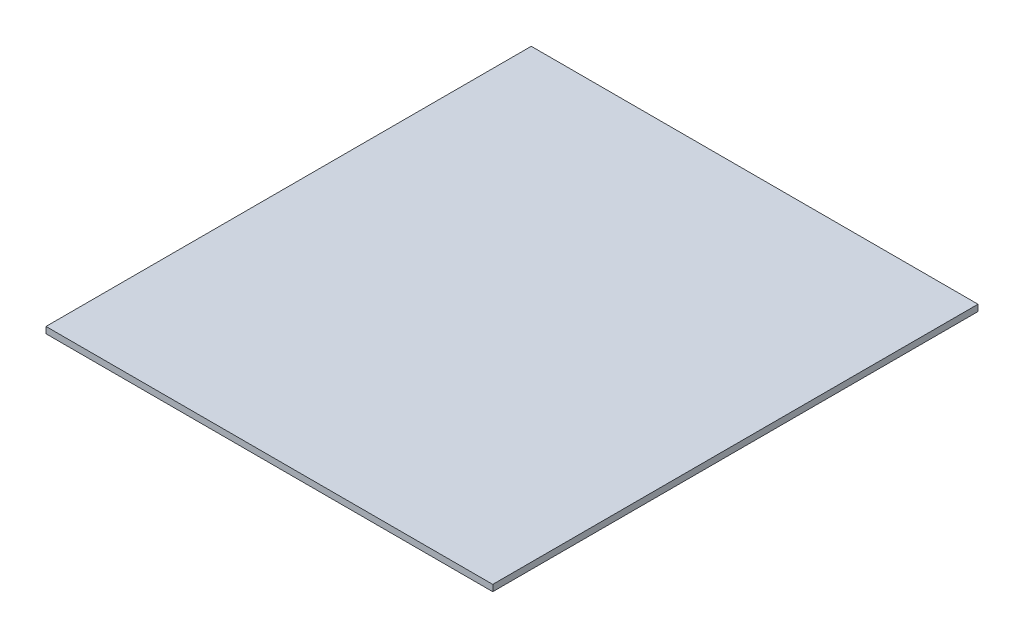
ISO-10303-21;
HEADER;
FILE_DESCRIPTION(('STEP AP214'),'2;1');
FILE_NAME('part.step','',(''),(''),'','','');
FILE_SCHEMA(('AUTOMOTIVE_DESIGN { 1 0 10303 214 1 1 1 1 }'));
ENDSEC;
DATA;
#1=APPLICATION_CONTEXT('core data for automotive mechanical design processes');
#2=APPLICATION_PROTOCOL_DEFINITION('international standard','automotive_design',2000,#1);
#3=PRODUCT_CONTEXT('',#1,'mechanical');
#4=PRODUCT('Part','Part','',(#3));
#5=PRODUCT_RELATED_PRODUCT_CATEGORY('part','',(#4));
#6=PRODUCT_DEFINITION_FORMATION('','',#4);
#7=PRODUCT_DEFINITION_CONTEXT('part definition',#1,'design');
#8=PRODUCT_DEFINITION('design','',#6,#7);
#9=PRODUCT_DEFINITION_SHAPE('','',#8);
#10=(LENGTH_UNIT() NAMED_UNIT(*) SI_UNIT(.MILLI.,.METRE.));
#11=(NAMED_UNIT(*) PLANE_ANGLE_UNIT() SI_UNIT($,.RADIAN.));
#12=(NAMED_UNIT(*) SI_UNIT($,.STERADIAN.) SOLID_ANGLE_UNIT());
#13=UNCERTAINTY_MEASURE_WITH_UNIT(LENGTH_MEASURE(1.E-05),#10,'distance_accuracy_value','');
#14=(GEOMETRIC_REPRESENTATION_CONTEXT(3) GLOBAL_UNCERTAINTY_ASSIGNED_CONTEXT((#13)) GLOBAL_UNIT_ASSIGNED_CONTEXT((#10,
#11,#12)) REPRESENTATION_CONTEXT('',''));
#15=CARTESIAN_POINT('',(0.,0.,0.));
#16=DIRECTION('',(0.,0.,1.));
#17=DIRECTION('',(1.,0.,0.));
#18=AXIS2_PLACEMENT_3D('',#15,#16,#17);
#19=CARTESIAN_POINT('',(-105.,3.,0.));
#20=DIRECTION('',(1.,0.,0.));
#21=DIRECTION('',(0.,0.,-1.));
#22=AXIS2_PLACEMENT_3D('',#19,#20,#21);
#23=PLANE('',#22);
#24=DIRECTION('',(0.,0.,1.));
#25=VECTOR('',#24,1.);
#26=CARTESIAN_POINT('',(-105.,0.,0.));
#27=LINE('',#26,#25);
#28=CARTESIAN_POINT('',(-105.,0.,0.));
#29=VERTEX_POINT('',#28);
#30=CARTESIAN_POINT('',(-105.,0.,228.092));
#31=VERTEX_POINT('',#30);
#32=EDGE_CURVE('E96',#29,#31,#27,.T.);
#33=ORIENTED_EDGE('',*,*,#32,.T.);
#34=DIRECTION('',(0.,-1.,0.));
#35=VECTOR('',#34,1.);
#36=CARTESIAN_POINT('',(-105.,3.,228.092));
#37=LINE('',#36,#35);
#38=CARTESIAN_POINT('',(-105.,3.,228.092));
#39=VERTEX_POINT('',#38);
#40=EDGE_CURVE('E11',#39,#31,#37,.T.);
#41=ORIENTED_EDGE('',*,*,#40,.F.);
#42=DIRECTION('',(0.,0.,1.));
#43=VECTOR('',#42,1.);
#44=CARTESIAN_POINT('',(-105.,3.,0.));
#45=LINE('',#44,#43);
#46=CARTESIAN_POINT('',(-105.,3.,0.));
#47=VERTEX_POINT('',#46);
#48=EDGE_CURVE('E84',#47,#39,#45,.T.);
#49=ORIENTED_EDGE('',*,*,#48,.F.);
#50=DIRECTION('',(0.,-1.,0.));
#51=VECTOR('',#50,1.);
#52=CARTESIAN_POINT('',(-105.,3.,0.));
#53=LINE('',#52,#51);
#54=EDGE_CURVE('E92',#47,#29,#53,.T.);
#55=ORIENTED_EDGE('',*,*,#54,.T.);
#56=EDGE_LOOP('',(#33,#41,#49,#55));
#57=FACE_BOUND('',#56,.T.);
#58=ADVANCED_FACE('F33',(#57),#23,.F.);
#59=CARTESIAN_POINT('',(-105.,3.,228.092));
#60=DIRECTION('',(0.,0.,-1.));
#61=DIRECTION('',(-1.,0.,0.));
#62=AXIS2_PLACEMENT_3D('',#59,#60,#61);
#63=PLANE('',#62);
#64=DIRECTION('',(1.,0.,0.));
#65=VECTOR('',#64,1.);
#66=CARTESIAN_POINT('',(-105.,0.,228.092));
#67=LINE('',#66,#65);
#68=CARTESIAN_POINT('',(105.,0.,228.092));
#69=VERTEX_POINT('',#68);
#70=EDGE_CURVE('E88',#31,#69,#67,.T.);
#71=ORIENTED_EDGE('',*,*,#70,.T.);
#72=DIRECTION('',(0.,-1.,0.));
#73=VECTOR('',#72,1.);
#74=CARTESIAN_POINT('',(105.,3.,228.092));
#75=LINE('',#74,#73);
#76=CARTESIAN_POINT('',(105.,3.,228.092));
#77=VERTEX_POINT('',#76);
#78=EDGE_CURVE('E41',#77,#69,#75,.T.);
#79=ORIENTED_EDGE('',*,*,#78,.F.);
#80=DIRECTION('',(1.,0.,0.));
#81=VECTOR('',#80,1.);
#82=CARTESIAN_POINT('',(-105.,3.,228.092));
#83=LINE('',#82,#81);
#84=EDGE_CURVE('E79',#39,#77,#83,.T.);
#85=ORIENTED_EDGE('',*,*,#84,.F.);
#86=ORIENTED_EDGE('',*,*,#40,.T.);
#87=EDGE_LOOP('',(#71,#79,#85,#86));
#88=FACE_BOUND('',#87,.T.);
#89=ADVANCED_FACE('F87',(#88),#63,.F.);
#90=CARTESIAN_POINT('',(105.,3.,0.));
#91=DIRECTION('',(-1.,0.,0.));
#92=DIRECTION('',(0.,0.,1.));
#93=AXIS2_PLACEMENT_3D('',#90,#91,#92);
#94=PLANE('',#93);
#95=DIRECTION('',(0.,0.,-1.));
#96=VECTOR('',#95,1.);
#97=CARTESIAN_POINT('',(105.,0.,0.));
#98=LINE('',#97,#96);
#99=CARTESIAN_POINT('',(105.,0.,0.));
#100=VERTEX_POINT('',#99);
#101=EDGE_CURVE('E66',#69,#100,#98,.T.);
#102=ORIENTED_EDGE('',*,*,#101,.T.);
#103=DIRECTION('',(0.,-1.,0.));
#104=VECTOR('',#103,1.);
#105=CARTESIAN_POINT('',(105.,3.,0.));
#106=LINE('',#105,#104);
#107=CARTESIAN_POINT('',(105.,3.,0.));
#108=VERTEX_POINT('',#107);
#109=EDGE_CURVE('E89',#108,#100,#106,.T.);
#110=ORIENTED_EDGE('',*,*,#109,.F.);
#111=DIRECTION('',(0.,0.,-1.));
#112=VECTOR('',#111,1.);
#113=CARTESIAN_POINT('',(105.,3.,0.));
#114=LINE('',#113,#112);
#115=EDGE_CURVE('E82',#77,#108,#114,.T.);
#116=ORIENTED_EDGE('',*,*,#115,.F.);
#117=ORIENTED_EDGE('',*,*,#78,.T.);
#118=EDGE_LOOP('',(#102,#110,#116,#117));
#119=FACE_BOUND('',#118,.T.);
#120=ADVANCED_FACE('F90',(#119),#94,.F.);
#121=CARTESIAN_POINT('',(-105.,3.,0.));
#122=DIRECTION('',(0.,0.,1.));
#123=DIRECTION('',(1.,0.,0.));
#124=AXIS2_PLACEMENT_3D('',#121,#122,#123);
#125=PLANE('',#124);
#126=DIRECTION('',(-1.,0.,0.));
#127=VECTOR('',#126,1.);
#128=CARTESIAN_POINT('',(-105.,0.,0.));
#129=LINE('',#128,#127);
#130=EDGE_CURVE('E72',#100,#29,#129,.T.);
#131=ORIENTED_EDGE('',*,*,#130,.T.);
#132=ORIENTED_EDGE('',*,*,#54,.F.);
#133=DIRECTION('',(-1.,0.,0.));
#134=VECTOR('',#133,1.);
#135=CARTESIAN_POINT('',(-105.,3.,0.));
#136=LINE('',#135,#134);
#137=EDGE_CURVE('E49',#108,#47,#136,.T.);
#138=ORIENTED_EDGE('',*,*,#137,.F.);
#139=ORIENTED_EDGE('',*,*,#109,.T.);
#140=EDGE_LOOP('',(#131,#132,#138,#139));
#141=FACE_BOUND('',#140,.T.);
#142=ADVANCED_FACE('F103',(#141),#125,.F.);
#143=CARTESIAN_POINT('',(0.,3.,0.));
#144=DIRECTION('',(0.,1.,0.));
#145=DIRECTION('',(0.,0.,1.));
#146=AXIS2_PLACEMENT_3D('',#143,#144,#145);
#147=PLANE('',#146);
#148=ORIENTED_EDGE('',*,*,#48,.T.);
#149=ORIENTED_EDGE('',*,*,#84,.T.);
#150=ORIENTED_EDGE('',*,*,#115,.T.);
#151=ORIENTED_EDGE('',*,*,#137,.T.);
#152=EDGE_LOOP('',(#148,#149,#150,#151));
#153=FACE_BOUND('',#152,.T.);
#154=ADVANCED_FACE('F80',(#153),#147,.T.);
#155=CARTESIAN_POINT('',(0.,0.,0.));
#156=DIRECTION('',(0.,1.,0.));
#157=DIRECTION('',(0.,0.,1.));
#158=AXIS2_PLACEMENT_3D('',#155,#156,#157);
#159=PLANE('',#158);
#160=ORIENTED_EDGE('',*,*,#32,.F.);
#161=ORIENTED_EDGE('',*,*,#130,.F.);
#162=ORIENTED_EDGE('',*,*,#101,.F.);
#163=ORIENTED_EDGE('',*,*,#70,.F.);
#164=EDGE_LOOP('',(#160,#161,#162,#163));
#165=FACE_BOUND('',#164,.T.);
#166=ADVANCED_FACE('F106',(#165),#159,.F.);
#167=CLOSED_SHELL('',(#58,#89,#120,#142,#154,#166));
#168=MANIFOLD_SOLID_BREP('B2',#167);
#169=ADVANCED_BREP_SHAPE_REPRESENTATION('',(#18,#168),#14);
#170=SHAPE_DEFINITION_REPRESENTATION(#9,#169);
ENDSEC;
END-ISO-10303-21;
